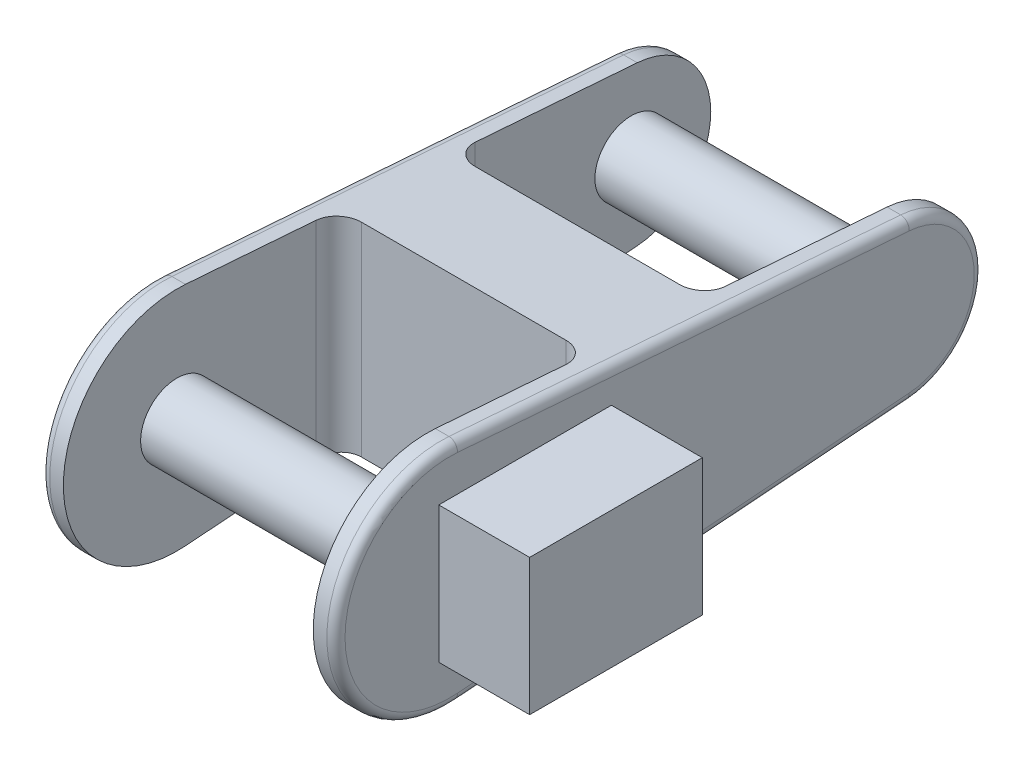
ISO-10303-21;
HEADER;
FILE_DESCRIPTION(('STEP AP214'),'2;1');
FILE_NAME('part.step','',(''),(''),'','','');
FILE_SCHEMA(('AUTOMOTIVE_DESIGN { 1 0 10303 214 1 1 1 1 }'));
ENDSEC;
DATA;
#1=APPLICATION_CONTEXT('core data for automotive mechanical design processes');
#2=APPLICATION_PROTOCOL_DEFINITION('international standard','automotive_design',2000,#1);
#3=PRODUCT_CONTEXT('',#1,'mechanical');
#4=PRODUCT('Part','Part','',(#3));
#5=PRODUCT_RELATED_PRODUCT_CATEGORY('part','',(#4));
#6=PRODUCT_DEFINITION_FORMATION('','',#4);
#7=PRODUCT_DEFINITION_CONTEXT('part definition',#1,'design');
#8=PRODUCT_DEFINITION('design','',#6,#7);
#9=PRODUCT_DEFINITION_SHAPE('','',#8);
#10=(LENGTH_UNIT() NAMED_UNIT(*) SI_UNIT(.MILLI.,.METRE.));
#11=(NAMED_UNIT(*) PLANE_ANGLE_UNIT() SI_UNIT($,.RADIAN.));
#12=(NAMED_UNIT(*) SI_UNIT($,.STERADIAN.) SOLID_ANGLE_UNIT());
#13=UNCERTAINTY_MEASURE_WITH_UNIT(LENGTH_MEASURE(1.E-05),#10,'distance_accuracy_value','');
#14=(GEOMETRIC_REPRESENTATION_CONTEXT(3) GLOBAL_UNCERTAINTY_ASSIGNED_CONTEXT((#13)) GLOBAL_UNIT_ASSIGNED_CONTEXT((#10,
#11,#12)) REPRESENTATION_CONTEXT('',''));
#15=CARTESIAN_POINT('',(0.,0.,0.));
#16=DIRECTION('',(0.,0.,1.));
#17=DIRECTION('',(1.,0.,0.));
#18=AXIS2_PLACEMENT_3D('',#15,#16,#17);
#19=CARTESIAN_POINT('',(32.5,0.,0.));
#20=DIRECTION('',(-1.,0.,0.));
#21=DIRECTION('',(0.,0.,1.));
#22=AXIS2_PLACEMENT_3D('',#19,#20,#21);
#23=CYLINDRICAL_SURFACE('',#22,25.);
#24=DIRECTION('',(-1.,0.,0.));
#25=VECTOR('',#24,1.);
#26=CARTESIAN_POINT('',(32.5,24.9295883439739,-1.875));
#27=LINE('',#26,#25);
#28=CARTESIAN_POINT('',(-27.5,24.9295883439739,-1.875));
#29=VERTEX_POINT('',#28);
#30=CARTESIAN_POINT('',(-30.5,24.9295883439739,-1.875));
#31=VERTEX_POINT('',#30);
#32=EDGE_CURVE('E252',#29,#31,#27,.T.);
#33=ORIENTED_EDGE('',*,*,#32,.T.);
#34=CARTESIAN_POINT('',(-30.5,0.,0.));
#35=DIRECTION('',(1.,0.,0.));
#36=DIRECTION('',(0.,0.,-1.));
#37=AXIS2_PLACEMENT_3D('',#34,#35,#36);
#38=CIRCLE('',#37,25.);
#39=CARTESIAN_POINT('',(-30.5,-24.9295883439739,-1.875));
#40=VERTEX_POINT('',#39);
#41=EDGE_CURVE('E343',#31,#40,#38,.T.);
#42=ORIENTED_EDGE('',*,*,#41,.T.);
#43=DIRECTION('',(-1.,0.,0.));
#44=VECTOR('',#43,1.);
#45=CARTESIAN_POINT('',(32.5,-24.9295883439739,-1.875));
#46=LINE('',#45,#44);
#47=CARTESIAN_POINT('',(-27.5,-24.9295883439739,-1.87499999999999));
#48=VERTEX_POINT('',#47);
#49=EDGE_CURVE('E263',#48,#40,#46,.T.);
#50=ORIENTED_EDGE('',*,*,#49,.F.);
#51=CARTESIAN_POINT('',(-27.5,0.,0.));
#52=DIRECTION('',(-1.,0.,0.));
#53=DIRECTION('',(0.,0.,1.));
#54=AXIS2_PLACEMENT_3D('',#51,#52,#53);
#55=CIRCLE('',#54,25.);
#56=EDGE_CURVE('E248',#48,#29,#55,.T.);
#57=ORIENTED_EDGE('',*,*,#56,.T.);
#58=EDGE_LOOP('',(#33,#42,#50,#57));
#59=FACE_BOUND('',#58,.T.);
#60=ADVANCED_FACE('F38',(#59),#23,.T.);
#61=CARTESIAN_POINT('',(32.5,0.,-100.));
#62=DIRECTION('',(-1.,0.,0.));
#63=DIRECTION('',(0.,0.,1.));
#64=AXIS2_PLACEMENT_3D('',#61,#62,#63);
#65=CYLINDRICAL_SURFACE('',#64,17.5);
#66=DIRECTION('',(-1.,0.,0.));
#67=VECTOR('',#66,1.);
#68=CARTESIAN_POINT('',(32.5,-17.4507118407818,-101.3125));
#69=LINE('',#68,#67);
#70=CARTESIAN_POINT('',(-27.5,-17.4507118407818,-101.3125));
#71=VERTEX_POINT('',#70);
#72=CARTESIAN_POINT('',(-30.5,-17.4507118407818,-101.3125));
#73=VERTEX_POINT('',#72);
#74=EDGE_CURVE('E259',#71,#73,#69,.T.);
#75=ORIENTED_EDGE('',*,*,#74,.T.);
#76=CARTESIAN_POINT('',(-30.5,0.,-100.));
#77=DIRECTION('',(1.,0.,0.));
#78=DIRECTION('',(0.,0.,-1.));
#79=AXIS2_PLACEMENT_3D('',#76,#77,#78);
#80=CIRCLE('',#79,17.5);
#81=CARTESIAN_POINT('',(-30.5,17.4507118407818,-101.3125));
#82=VERTEX_POINT('',#81);
#83=EDGE_CURVE('E317',#73,#82,#80,.T.);
#84=ORIENTED_EDGE('',*,*,#83,.T.);
#85=DIRECTION('',(-1.,0.,0.));
#86=VECTOR('',#85,1.);
#87=CARTESIAN_POINT('',(32.5,17.4507118407818,-101.3125));
#88=LINE('',#87,#86);
#89=CARTESIAN_POINT('',(-27.5,17.4507118407818,-101.3125));
#90=VERTEX_POINT('',#89);
#91=EDGE_CURVE('E256',#90,#82,#88,.T.);
#92=ORIENTED_EDGE('',*,*,#91,.F.);
#93=CARTESIAN_POINT('',(-27.5,0.,-100.));
#94=DIRECTION('',(-1.,0.,0.));
#95=DIRECTION('',(0.,0.,1.));
#96=AXIS2_PLACEMENT_3D('',#93,#94,#95);
#97=CIRCLE('',#96,17.5);
#98=EDGE_CURVE('E235',#90,#71,#97,.T.);
#99=ORIENTED_EDGE('',*,*,#98,.T.);
#100=EDGE_LOOP('',(#75,#84,#92,#99));
#101=FACE_BOUND('',#100,.T.);
#102=ADVANCED_FACE('F419',(#101),#65,.T.);
#103=CARTESIAN_POINT('',(30.5,-24.9295883439739,-1.875));
#104=VERTEX_POINT('',#103);
#105=CARTESIAN_POINT('',(27.5,-24.9295883439739,-1.87499999999999));
#106=VERTEX_POINT('',#105);
#107=EDGE_CURVE('E264',#104,#106,#46,.T.);
#108=ORIENTED_EDGE('',*,*,#107,.F.);
#109=CARTESIAN_POINT('',(30.5,0.,0.));
#110=DIRECTION('',(1.,0.,0.));
#111=DIRECTION('',(0.,0.,-1.));
#112=AXIS2_PLACEMENT_3D('',#109,#110,#111);
#113=CIRCLE('',#112,25.);
#114=CARTESIAN_POINT('',(30.5,24.9295883439739,-1.875));
#115=VERTEX_POINT('',#114);
#116=EDGE_CURVE('E313',#104,#115,#113,.F.);
#117=ORIENTED_EDGE('',*,*,#116,.T.);
#118=CARTESIAN_POINT('',(27.5,24.9295883439739,-1.875));
#119=VERTEX_POINT('',#118);
#120=EDGE_CURVE('E253',#115,#119,#27,.T.);
#121=ORIENTED_EDGE('',*,*,#120,.T.);
#122=CARTESIAN_POINT('',(27.5,0.,0.));
#123=DIRECTION('',(1.,0.,0.));
#124=DIRECTION('',(0.,0.,-1.));
#125=AXIS2_PLACEMENT_3D('',#122,#123,#124);
#126=CIRCLE('',#125,25.);
#127=EDGE_CURVE('E241',#119,#106,#126,.T.);
#128=ORIENTED_EDGE('',*,*,#127,.T.);
#129=EDGE_LOOP('',(#108,#117,#121,#128));
#130=FACE_BOUND('',#129,.T.);
#131=ADVANCED_FACE('F422',(#130),#23,.T.);
#132=CARTESIAN_POINT('',(32.5,-24.9295883439739,-1.875));
#133=DIRECTION('',(0.,0.997183533758957,0.0749999999999998));
#134=DIRECTION('',(0.,-0.0749999999999998,0.997183533758957));
#135=AXIS2_PLACEMENT_3D('',#132,#133,#134);
#136=PLANE('',#135);
#137=ORIENTED_EDGE('',*,*,#49,.T.);
#138=DIRECTION('',(0.,0.0749999999999998,-0.997183533758957));
#139=VECTOR('',#138,1.);
#140=CARTESIAN_POINT('',(-30.5,-24.9295883439739,-1.875));
#141=LINE('',#140,#139);
#142=EDGE_CURVE('E341',#40,#73,#141,.T.);
#143=ORIENTED_EDGE('',*,*,#142,.T.);
#144=ORIENTED_EDGE('',*,*,#74,.F.);
#145=DIRECTION('',(0.,-0.0749999999999998,0.997183533758957));
#146=VECTOR('',#145,1.);
#147=CARTESIAN_POINT('',(-27.5,-24.9295883439739,-1.875));
#148=LINE('',#147,#146);
#149=CARTESIAN_POINT('',(-27.5,-20.1340632159431,-65.6352492453292));
#150=VERTEX_POINT('',#149);
#151=EDGE_CURVE('E238',#71,#150,#148,.T.);
#152=ORIENTED_EDGE('',*,*,#151,.T.);
#153=CARTESIAN_POINT('',(-22.5,-20.1340632159431,-65.6352492453292));
#154=DIRECTION('',(0.,0.997183533758957,0.0749999999999998));
#155=DIRECTION('',(0.,-0.0749999999999998,0.997183533758957));
#156=AXIS2_PLACEMENT_3D('',#153,#154,#155);
#157=ELLIPSE('',#156,5.014122105639,5.);
#158=CARTESIAN_POINT('',(-22.5,-20.510122373866,-60.6352492453292));
#159=VERTEX_POINT('',#158);
#160=EDGE_CURVE('E373',#150,#159,#157,.T.);
#161=ORIENTED_EDGE('',*,*,#160,.T.);
#162=DIRECTION('',(1.,0.,0.));
#163=VECTOR('',#162,1.);
#164=CARTESIAN_POINT('',(32.5,-20.510122373866,-60.6352492453292));
#165=LINE('',#164,#163);
#166=CARTESIAN_POINT('',(22.5,-20.510122373866,-60.6352492453292));
#167=VERTEX_POINT('',#166);
#168=EDGE_CURVE('E223',#159,#167,#165,.T.);
#169=ORIENTED_EDGE('',*,*,#168,.T.);
#170=CARTESIAN_POINT('',(22.5,-20.1340632159431,-65.6352492453292));
#171=DIRECTION('',(0.,0.997183533758957,0.0749999999999998));
#172=DIRECTION('',(0.,-0.0749999999999998,0.997183533758957));
#173=AXIS2_PLACEMENT_3D('',#170,#171,#172);
#174=ELLIPSE('',#173,5.014122105639,5.);
#175=CARTESIAN_POINT('',(27.5,-20.1340632159431,-65.6352492453292));
#176=VERTEX_POINT('',#175);
#177=EDGE_CURVE('E364',#167,#176,#174,.T.);
#178=ORIENTED_EDGE('',*,*,#177,.T.);
#179=DIRECTION('',(0.,0.0749999999999998,-0.997183533758957));
#180=VECTOR('',#179,1.);
#181=CARTESIAN_POINT('',(27.5,-24.9295883439739,-1.875));
#182=LINE('',#181,#180);
#183=CARTESIAN_POINT('',(27.5,-17.4507118407818,-101.3125));
#184=VERTEX_POINT('',#183);
#185=EDGE_CURVE('E233',#176,#184,#182,.T.);
#186=ORIENTED_EDGE('',*,*,#185,.T.);
#187=CARTESIAN_POINT('',(30.5,-17.4507118407818,-101.3125));
#188=VERTEX_POINT('',#187);
#189=EDGE_CURVE('E260',#188,#184,#69,.T.);
#190=ORIENTED_EDGE('',*,*,#189,.F.);
#191=DIRECTION('',(0.,0.0749999999999998,-0.997183533758957));
#192=VECTOR('',#191,1.);
#193=CARTESIAN_POINT('',(30.5,-24.9295883439739,-1.875));
#194=LINE('',#193,#192);
#195=EDGE_CURVE('E311',#188,#104,#194,.F.);
#196=ORIENTED_EDGE('',*,*,#195,.T.);
#197=ORIENTED_EDGE('',*,*,#107,.T.);
#198=DIRECTION('',(0.,0.0749999999999998,-0.997183533758957));
#199=VECTOR('',#198,1.);
#200=CARTESIAN_POINT('',(27.5,-24.9295883439739,-1.875));
#201=LINE('',#200,#199);
#202=CARTESIAN_POINT('',(27.5,-22.7664773214035,-30.6352492453292));
#203=VERTEX_POINT('',#202);
#204=EDGE_CURVE('E244',#106,#203,#201,.T.);
#205=ORIENTED_EDGE('',*,*,#204,.T.);
#206=CARTESIAN_POINT('',(22.5,-22.7664773214035,-30.6352492453292));
#207=DIRECTION('',(0.,0.997183533758957,0.0749999999999998));
#208=DIRECTION('',(0.,-0.0749999999999998,0.997183533758957));
#209=AXIS2_PLACEMENT_3D('',#206,#207,#208);
#210=ELLIPSE('',#209,5.014122105639,5.);
#211=CARTESIAN_POINT('',(22.5,-22.3904181634806,-35.6352492453292));
#212=VERTEX_POINT('',#211);
#213=EDGE_CURVE('E11',#203,#212,#210,.T.);
#214=ORIENTED_EDGE('',*,*,#213,.T.);
#215=DIRECTION('',(-1.,0.,0.));
#216=VECTOR('',#215,1.);
#217=CARTESIAN_POINT('',(32.5,-22.3904181634806,-35.6352492453292));
#218=LINE('',#217,#216);
#219=CARTESIAN_POINT('',(-22.5,-22.3904181634806,-35.6352492453292));
#220=VERTEX_POINT('',#219);
#221=EDGE_CURVE('E246',#212,#220,#218,.T.);
#222=ORIENTED_EDGE('',*,*,#221,.T.);
#223=CARTESIAN_POINT('',(-22.5,-22.7664773214035,-30.6352492453292));
#224=DIRECTION('',(0.,0.997183533758957,0.0749999999999998));
#225=DIRECTION('',(0.,-0.0749999999999998,0.997183533758957));
#226=AXIS2_PLACEMENT_3D('',#223,#224,#225);
#227=ELLIPSE('',#226,5.014122105639,5.);
#228=CARTESIAN_POINT('',(-27.5,-22.7664773214035,-30.6352492453292));
#229=VERTEX_POINT('',#228);
#230=EDGE_CURVE('E383',#220,#229,#227,.T.);
#231=ORIENTED_EDGE('',*,*,#230,.T.);
#232=DIRECTION('',(0.,-0.0749999999999998,0.997183533758957));
#233=VECTOR('',#232,1.);
#234=CARTESIAN_POINT('',(-27.5,-24.9295883439739,-1.875));
#235=LINE('',#234,#233);
#236=EDGE_CURVE('E250',#229,#48,#235,.T.);
#237=ORIENTED_EDGE('',*,*,#236,.T.);
#238=EDGE_LOOP('',(#137,#143,#144,#152,#161,#169,#178,#186,#190,#196,#197,#205,#214,#222,#231,#237));
#239=FACE_BOUND('',#238,.T.);
#240=ADVANCED_FACE('F411',(#239),#136,.F.);
#241=CARTESIAN_POINT('',(30.5,17.4507118407818,-101.3125));
#242=VERTEX_POINT('',#241);
#243=CARTESIAN_POINT('',(27.5,17.4507118407818,-101.3125));
#244=VERTEX_POINT('',#243);
#245=EDGE_CURVE('E257',#242,#244,#88,.T.);
#246=ORIENTED_EDGE('',*,*,#245,.F.);
#247=CARTESIAN_POINT('',(30.5,0.,-100.));
#248=DIRECTION('',(1.,0.,0.));
#249=DIRECTION('',(0.,0.,-1.));
#250=AXIS2_PLACEMENT_3D('',#247,#248,#249);
#251=CIRCLE('',#250,17.5);
#252=EDGE_CURVE('E308',#242,#188,#251,.F.);
#253=ORIENTED_EDGE('',*,*,#252,.T.);
#254=ORIENTED_EDGE('',*,*,#189,.T.);
#255=CARTESIAN_POINT('',(27.5,0.,-100.));
#256=DIRECTION('',(1.,0.,0.));
#257=DIRECTION('',(0.,0.,-1.));
#258=AXIS2_PLACEMENT_3D('',#255,#256,#257);
#259=CIRCLE('',#258,17.5);
#260=EDGE_CURVE('E225',#184,#244,#259,.T.);
#261=ORIENTED_EDGE('',*,*,#260,.T.);
#262=EDGE_LOOP('',(#246,#253,#254,#261));
#263=FACE_BOUND('',#262,.T.);
#264=ADVANCED_FACE('F428',(#263),#65,.T.);
#265=CARTESIAN_POINT('',(32.5,24.9295883439739,-1.875));
#266=DIRECTION('',(0.,-0.997183533758957,0.0749999999999998));
#267=DIRECTION('',(0.,-0.0749999999999998,-0.997183533758957));
#268=AXIS2_PLACEMENT_3D('',#265,#266,#267);
#269=PLANE('',#268);
#270=ORIENTED_EDGE('',*,*,#91,.T.);
#271=DIRECTION('',(0.,0.0749999999999998,0.997183533758957));
#272=VECTOR('',#271,1.);
#273=CARTESIAN_POINT('',(-30.5,24.9295883439739,-1.875));
#274=LINE('',#273,#272);
#275=EDGE_CURVE('E345',#82,#31,#274,.T.);
#276=ORIENTED_EDGE('',*,*,#275,.T.);
#277=ORIENTED_EDGE('',*,*,#32,.F.);
#278=DIRECTION('',(0.,-0.0749999999999998,-0.997183533758957));
#279=VECTOR('',#278,1.);
#280=CARTESIAN_POINT('',(-27.5,24.9295883439739,-1.875));
#281=LINE('',#280,#279);
#282=CARTESIAN_POINT('',(-27.5,22.7664773214035,-30.6352492453292));
#283=VERTEX_POINT('',#282);
#284=EDGE_CURVE('E278',#29,#283,#281,.T.);
#285=ORIENTED_EDGE('',*,*,#284,.T.);
#286=CARTESIAN_POINT('',(-22.5,22.7664773214035,-30.6352492453292));
#287=DIRECTION('',(0.,-0.997183533758957,0.0749999999999998));
#288=DIRECTION('',(0.,-0.0749999999999998,-0.997183533758957));
#289=AXIS2_PLACEMENT_3D('',#286,#287,#288);
#290=ELLIPSE('',#289,5.014122105639,5.);
#291=CARTESIAN_POINT('',(-22.5,22.3904181634806,-35.6352492453292));
#292=VERTEX_POINT('',#291);
#293=EDGE_CURVE('E381',#283,#292,#290,.T.);
#294=ORIENTED_EDGE('',*,*,#293,.T.);
#295=DIRECTION('',(1.,0.,0.));
#296=VECTOR('',#295,1.);
#297=CARTESIAN_POINT('',(32.5,22.3904181634806,-35.6352492453292));
#298=LINE('',#297,#296);
#299=CARTESIAN_POINT('',(22.5,22.3904181634806,-35.6352492453292));
#300=VERTEX_POINT('',#299);
#301=EDGE_CURVE('E276',#292,#300,#298,.T.);
#302=ORIENTED_EDGE('',*,*,#301,.T.);
#303=CARTESIAN_POINT('',(22.5,22.7664773214035,-30.6352492453292));
#304=DIRECTION('',(0.,-0.997183533758957,0.0749999999999998));
#305=DIRECTION('',(0.,-0.0749999999999998,-0.997183533758957));
#306=AXIS2_PLACEMENT_3D('',#303,#304,#305);
#307=ELLIPSE('',#306,5.014122105639,5.);
#308=CARTESIAN_POINT('',(27.5,22.7664773214035,-30.6352492453292));
#309=VERTEX_POINT('',#308);
#310=EDGE_CURVE('E46',#300,#309,#307,.T.);
#311=ORIENTED_EDGE('',*,*,#310,.T.);
#312=DIRECTION('',(0.,0.0749999999999998,0.997183533758957));
#313=VECTOR('',#312,1.);
#314=CARTESIAN_POINT('',(27.5,24.9295883439739,-1.875));
#315=LINE('',#314,#313);
#316=EDGE_CURVE('E274',#309,#119,#315,.T.);
#317=ORIENTED_EDGE('',*,*,#316,.T.);
#318=ORIENTED_EDGE('',*,*,#120,.F.);
#319=DIRECTION('',(0.,0.0749999999999998,0.997183533758957));
#320=VECTOR('',#319,1.);
#321=CARTESIAN_POINT('',(30.5,17.4507118407818,-101.3125));
#322=LINE('',#321,#320);
#323=EDGE_CURVE('E315',#115,#242,#322,.F.);
#324=ORIENTED_EDGE('',*,*,#323,.T.);
#325=ORIENTED_EDGE('',*,*,#245,.T.);
#326=DIRECTION('',(0.,0.0749999999999998,0.997183533758957));
#327=VECTOR('',#326,1.);
#328=CARTESIAN_POINT('',(27.5,24.9295883439739,-1.875));
#329=LINE('',#328,#327);
#330=CARTESIAN_POINT('',(27.5,20.1340632159431,-65.6352492453292));
#331=VERTEX_POINT('',#330);
#332=EDGE_CURVE('E269',#244,#331,#329,.T.);
#333=ORIENTED_EDGE('',*,*,#332,.T.);
#334=CARTESIAN_POINT('',(22.5,20.1340632159431,-65.6352492453292));
#335=DIRECTION('',(0.,-0.997183533758957,0.0749999999999998));
#336=DIRECTION('',(0.,-0.0749999999999998,-0.997183533758957));
#337=AXIS2_PLACEMENT_3D('',#334,#335,#336);
#338=ELLIPSE('',#337,5.014122105639,5.);
#339=CARTESIAN_POINT('',(22.5,20.510122373866,-60.6352492453292));
#340=VERTEX_POINT('',#339);
#341=EDGE_CURVE('E362',#331,#340,#338,.T.);
#342=ORIENTED_EDGE('',*,*,#341,.T.);
#343=DIRECTION('',(-1.,0.,0.));
#344=VECTOR('',#343,1.);
#345=CARTESIAN_POINT('',(32.5,20.510122373866,-60.6352492453292));
#346=LINE('',#345,#344);
#347=CARTESIAN_POINT('',(-22.5,20.510122373866,-60.6352492453292));
#348=VERTEX_POINT('',#347);
#349=EDGE_CURVE('E266',#340,#348,#346,.T.);
#350=ORIENTED_EDGE('',*,*,#349,.T.);
#351=CARTESIAN_POINT('',(-22.5,20.1340632159431,-65.6352492453292));
#352=DIRECTION('',(0.,-0.997183533758957,0.0749999999999998));
#353=DIRECTION('',(0.,-0.0749999999999998,-0.997183533758957));
#354=AXIS2_PLACEMENT_3D('',#351,#352,#353);
#355=ELLIPSE('',#354,5.014122105639,5.);
#356=CARTESIAN_POINT('',(-27.5,20.1340632159431,-65.6352492453292));
#357=VERTEX_POINT('',#356);
#358=EDGE_CURVE('E371',#348,#357,#355,.T.);
#359=ORIENTED_EDGE('',*,*,#358,.T.);
#360=DIRECTION('',(0.,-0.0749999999999998,-0.997183533758957));
#361=VECTOR('',#360,1.);
#362=CARTESIAN_POINT('',(-27.5,24.9295883439739,-1.875));
#363=LINE('',#362,#361);
#364=EDGE_CURVE('E272',#357,#90,#363,.T.);
#365=ORIENTED_EDGE('',*,*,#364,.T.);
#366=EDGE_LOOP('',(#270,#276,#277,#285,#294,#302,#311,#317,#318,#324,#325,#333,#342,#350,#359,#365));
#367=FACE_BOUND('',#366,.T.);
#368=ADVANCED_FACE('F397',(#367),#269,.F.);
#369=CARTESIAN_POINT('',(32.5,0.,0.));
#370=DIRECTION('',(1.,0.,0.));
#371=DIRECTION('',(0.,0.,-1.));
#372=AXIS2_PLACEMENT_3D('',#369,#370,#371);
#373=PLANE('',#372);
#374=DIRECTION('',(0.,0.0749999999999998,-0.997183533758957));
#375=VECTOR('',#374,1.);
#376=CARTESIAN_POINT('',(32.5,-15.4563447732639,-101.1625));
#377=LINE('',#376,#375);
#378=CARTESIAN_POINT('',(32.5,-22.935221276456,-1.725));
#379=VERTEX_POINT('',#378);
#380=CARTESIAN_POINT('',(32.5,-15.4563447732638,-101.1625));
#381=VERTEX_POINT('',#380);
#382=EDGE_CURVE('E303',#379,#381,#377,.T.);
#383=ORIENTED_EDGE('',*,*,#382,.T.);
#384=CARTESIAN_POINT('',(32.5,0.,-100.));
#385=DIRECTION('',(1.,0.,0.));
#386=DIRECTION('',(0.,0.,-1.));
#387=AXIS2_PLACEMENT_3D('',#384,#385,#386);
#388=CIRCLE('',#387,15.5);
#389=CARTESIAN_POINT('',(32.5,15.4563447732638,-101.1625));
#390=VERTEX_POINT('',#389);
#391=EDGE_CURVE('E305',#381,#390,#388,.T.);
#392=ORIENTED_EDGE('',*,*,#391,.T.);
#393=DIRECTION('',(0.,0.0749999999999998,0.997183533758957));
#394=VECTOR('',#393,1.);
#395=CARTESIAN_POINT('',(32.5,22.935221276456,-1.725));
#396=LINE('',#395,#394);
#397=CARTESIAN_POINT('',(32.5,22.935221276456,-1.725));
#398=VERTEX_POINT('',#397);
#399=EDGE_CURVE('E299',#390,#398,#396,.T.);
#400=ORIENTED_EDGE('',*,*,#399,.T.);
#401=CARTESIAN_POINT('',(32.5,0.,0.));
#402=DIRECTION('',(1.,0.,0.));
#403=DIRECTION('',(0.,0.,-1.));
#404=AXIS2_PLACEMENT_3D('',#401,#402,#403);
#405=CIRCLE('',#404,23.);
#406=EDGE_CURVE('E301',#398,#379,#405,.T.);
#407=ORIENTED_EDGE('',*,*,#406,.T.);
#408=EDGE_LOOP('',(#383,#392,#400,#407));
#409=FACE_BOUND('',#408,.T.);
#410=DIRECTION('',(0.,1.,0.));
#411=VECTOR('',#410,1.);
#412=CARTESIAN_POINT('',(32.5,-15.,-35.6352492453292));
#413=LINE('',#412,#411);
#414=CARTESIAN_POINT('',(32.5,-15.,-35.6352492453292));
#415=VERTEX_POINT('',#414);
#416=CARTESIAN_POINT('',(32.5,15.,-35.6352492453292));
#417=VERTEX_POINT('',#416);
#418=EDGE_CURVE('E222',#415,#417,#413,.T.);
#419=ORIENTED_EDGE('',*,*,#418,.F.);
#420=DIRECTION('',(0.,0.,-1.));
#421=VECTOR('',#420,1.);
#422=CARTESIAN_POINT('',(32.5,-15.,2.36475075467077));
#423=LINE('',#422,#421);
#424=CARTESIAN_POINT('',(32.5,-15.,2.36475075467077));
#425=VERTEX_POINT('',#424);
#426=EDGE_CURVE('E219',#425,#415,#423,.T.);
#427=ORIENTED_EDGE('',*,*,#426,.F.);
#428=DIRECTION('',(0.,-1.,0.));
#429=VECTOR('',#428,1.);
#430=CARTESIAN_POINT('',(32.5,15.,2.36475075467078));
#431=LINE('',#430,#429);
#432=CARTESIAN_POINT('',(32.5,15.,2.36475075467078));
#433=VERTEX_POINT('',#432);
#434=EDGE_CURVE('E818',#433,#425,#431,.T.);
#435=ORIENTED_EDGE('',*,*,#434,.F.);
#436=DIRECTION('',(0.,0.,1.));
#437=VECTOR('',#436,1.);
#438=CARTESIAN_POINT('',(32.5,15.,2.36475075467078));
#439=LINE('',#438,#437);
#440=EDGE_CURVE('E820',#417,#433,#439,.T.);
#441=ORIENTED_EDGE('',*,*,#440,.F.);
#442=EDGE_LOOP('',(#419,#427,#435,#441));
#443=FACE_BOUND('',#442,.T.);
#444=ADVANCED_FACE('F454',(#409,#443),#373,.T.);
#445=CARTESIAN_POINT('',(-32.5,0.,0.));
#446=DIRECTION('',(1.,0.,0.));
#447=DIRECTION('',(0.,0.,-1.));
#448=AXIS2_PLACEMENT_3D('',#445,#446,#447);
#449=PLANE('',#448);
#450=DIRECTION('',(0.,0.0749999999999998,0.997183533758957));
#451=VECTOR('',#450,1.);
#452=CARTESIAN_POINT('',(-32.5,22.935221276456,-1.725));
#453=LINE('',#452,#451);
#454=CARTESIAN_POINT('',(-32.5,22.935221276456,-1.725));
#455=VERTEX_POINT('',#454);
#456=CARTESIAN_POINT('',(-32.5,15.4563447732638,-101.1625));
#457=VERTEX_POINT('',#456);
#458=EDGE_CURVE('E332',#455,#457,#453,.F.);
#459=ORIENTED_EDGE('',*,*,#458,.T.);
#460=CARTESIAN_POINT('',(-32.5,0.,-100.));
#461=DIRECTION('',(1.,0.,0.));
#462=DIRECTION('',(0.,0.,-1.));
#463=AXIS2_PLACEMENT_3D('',#460,#461,#462);
#464=CIRCLE('',#463,15.5);
#465=CARTESIAN_POINT('',(-32.5,-15.4563447732638,-101.1625));
#466=VERTEX_POINT('',#465);
#467=EDGE_CURVE('E338',#457,#466,#464,.F.);
#468=ORIENTED_EDGE('',*,*,#467,.T.);
#469=DIRECTION('',(0.,0.0749999999999998,-0.997183533758957));
#470=VECTOR('',#469,1.);
#471=CARTESIAN_POINT('',(-32.5,-22.935221276456,-1.725));
#472=LINE('',#471,#470);
#473=CARTESIAN_POINT('',(-32.5,-22.935221276456,-1.725));
#474=VERTEX_POINT('',#473);
#475=EDGE_CURVE('E336',#466,#474,#472,.F.);
#476=ORIENTED_EDGE('',*,*,#475,.T.);
#477=CARTESIAN_POINT('',(-32.5,0.,0.));
#478=DIRECTION('',(1.,0.,0.));
#479=DIRECTION('',(0.,0.,-1.));
#480=AXIS2_PLACEMENT_3D('',#477,#478,#479);
#481=CIRCLE('',#480,23.);
#482=EDGE_CURVE('E334',#474,#455,#481,.F.);
#483=ORIENTED_EDGE('',*,*,#482,.T.);
#484=EDGE_LOOP('',(#459,#468,#476,#483));
#485=FACE_BOUND('',#484,.T.);
#486=ADVANCED_FACE('F533',(#485),#449,.F.);
#487=CARTESIAN_POINT('',(-27.5,-32.5,-117.5));
#488=DIRECTION('',(-1.,0.,0.));
#489=DIRECTION('',(0.,0.,1.));
#490=AXIS2_PLACEMENT_3D('',#487,#488,#489);
#491=PLANE('',#490);
#492=CARTESIAN_POINT('',(-27.5,0.,-100.));
#493=DIRECTION('',(-1.,0.,0.));
#494=DIRECTION('',(0.,0.,1.));
#495=AXIS2_PLACEMENT_3D('',#492,#493,#494);
#496=CIRCLE('',#495,8.00000000000001);
#497=CARTESIAN_POINT('',(-27.5,0.,-92.));
#498=VERTEX_POINT('',#497);
#499=EDGE_CURVE('E290',#498,#498,#496,.F.);
#500=ORIENTED_EDGE('',*,*,#499,.F.);
#501=EDGE_LOOP('',(#500));
#502=FACE_BOUND('',#501,.T.);
#503=ORIENTED_EDGE('',*,*,#364,.F.);
#504=DIRECTION('',(0.,1.,0.));
#505=VECTOR('',#504,1.);
#506=CARTESIAN_POINT('',(-27.5,-20.510122373866,-65.6352492453292));
#507=LINE('',#506,#505);
#508=EDGE_CURVE('E369',#357,#150,#507,.F.);
#509=ORIENTED_EDGE('',*,*,#508,.T.);
#510=ORIENTED_EDGE('',*,*,#151,.F.);
#511=ORIENTED_EDGE('',*,*,#98,.F.);
#512=EDGE_LOOP('',(#503,#509,#510,#511));
#513=FACE_BOUND('',#512,.T.);
#514=ADVANCED_FACE('F520',(#502,#513),#491,.F.);
#515=CARTESIAN_POINT('',(27.5,-32.5,-117.5));
#516=DIRECTION('',(1.,0.,0.));
#517=DIRECTION('',(0.,0.,-1.));
#518=AXIS2_PLACEMENT_3D('',#515,#516,#517);
#519=PLANE('',#518);
#520=CARTESIAN_POINT('',(27.5,0.,-100.));
#521=DIRECTION('',(1.,0.,0.));
#522=DIRECTION('',(0.,0.,-1.));
#523=AXIS2_PLACEMENT_3D('',#520,#521,#522);
#524=CIRCLE('',#523,8.00000000000001);
#525=CARTESIAN_POINT('',(27.5,0.,-108.));
#526=VERTEX_POINT('',#525);
#527=EDGE_CURVE('E287',#526,#526,#524,.F.);
#528=ORIENTED_EDGE('',*,*,#527,.F.);
#529=EDGE_LOOP('',(#528));
#530=FACE_BOUND('',#529,.T.);
#531=ORIENTED_EDGE('',*,*,#185,.F.);
#532=DIRECTION('',(0.,1.,0.));
#533=VECTOR('',#532,1.);
#534=CARTESIAN_POINT('',(27.5,20.510122373866,-65.6352492453292));
#535=LINE('',#534,#533);
#536=EDGE_CURVE('E347',#176,#331,#535,.T.);
#537=ORIENTED_EDGE('',*,*,#536,.T.);
#538=ORIENTED_EDGE('',*,*,#332,.F.);
#539=ORIENTED_EDGE('',*,*,#260,.F.);
#540=EDGE_LOOP('',(#531,#537,#538,#539));
#541=FACE_BOUND('',#540,.T.);
#542=ADVANCED_FACE('F516',(#530,#541),#519,.F.);
#543=CARTESIAN_POINT('',(-27.5,-32.5,-60.6352492453292));
#544=DIRECTION('',(0.,0.,1.));
#545=DIRECTION('',(1.,0.,0.));
#546=AXIS2_PLACEMENT_3D('',#543,#544,#545);
#547=PLANE('',#546);
#548=ORIENTED_EDGE('',*,*,#168,.F.);
#549=DIRECTION('',(0.,1.,0.));
#550=VECTOR('',#549,1.);
#551=CARTESIAN_POINT('',(-22.5,20.510122373866,-60.6352492453292));
#552=LINE('',#551,#550);
#553=EDGE_CURVE('E366',#159,#348,#552,.T.);
#554=ORIENTED_EDGE('',*,*,#553,.T.);
#555=ORIENTED_EDGE('',*,*,#349,.F.);
#556=DIRECTION('',(0.,1.,0.));
#557=VECTOR('',#556,1.);
#558=CARTESIAN_POINT('',(22.5,-20.510122373866,-60.6352492453292));
#559=LINE('',#558,#557);
#560=EDGE_CURVE('E359',#340,#167,#559,.F.);
#561=ORIENTED_EDGE('',*,*,#560,.T.);
#562=EDGE_LOOP('',(#548,#554,#555,#561));
#563=FACE_BOUND('',#562,.T.);
#564=ADVANCED_FACE('F509',(#563),#547,.F.);
#565=CARTESIAN_POINT('',(-27.5,-32.5,-35.6352492453292));
#566=DIRECTION('',(-1.,0.,0.));
#567=DIRECTION('',(0.,0.,1.));
#568=AXIS2_PLACEMENT_3D('',#565,#566,#567);
#569=PLANE('',#568);
#570=CARTESIAN_POINT('',(-27.5,0.,0.));
#571=DIRECTION('',(-1.,0.,0.));
#572=DIRECTION('',(0.,0.,1.));
#573=AXIS2_PLACEMENT_3D('',#570,#571,#572);
#574=CIRCLE('',#573,8.);
#575=CARTESIAN_POINT('',(-27.5,0.,8.));
#576=VERTEX_POINT('',#575);
#577=EDGE_CURVE('E284',#576,#576,#574,.F.);
#578=ORIENTED_EDGE('',*,*,#577,.F.);
#579=EDGE_LOOP('',(#578));
#580=FACE_BOUND('',#579,.T.);
#581=ORIENTED_EDGE('',*,*,#236,.F.);
#582=DIRECTION('',(0.,1.,0.));
#583=VECTOR('',#582,1.);
#584=CARTESIAN_POINT('',(-27.5,22.3904181634806,-30.6352492453292));
#585=LINE('',#584,#583);
#586=EDGE_CURVE('E375',#229,#283,#585,.T.);
#587=ORIENTED_EDGE('',*,*,#586,.T.);
#588=ORIENTED_EDGE('',*,*,#284,.F.);
#589=ORIENTED_EDGE('',*,*,#56,.F.);
#590=EDGE_LOOP('',(#581,#587,#588,#589));
#591=FACE_BOUND('',#590,.T.);
#592=ADVANCED_FACE('F406',(#580,#591),#569,.F.);
#593=CARTESIAN_POINT('',(-27.5,-32.5,-35.6352492453292));
#594=DIRECTION('',(0.,0.,-1.));
#595=DIRECTION('',(-1.,0.,0.));
#596=AXIS2_PLACEMENT_3D('',#593,#594,#595);
#597=PLANE('',#596);
#598=ORIENTED_EDGE('',*,*,#221,.F.);
#599=DIRECTION('',(0.,1.,0.));
#600=VECTOR('',#599,1.);
#601=CARTESIAN_POINT('',(22.5,22.3904181634806,-35.6352492453292));
#602=LINE('',#601,#600);
#603=EDGE_CURVE('E385',#212,#300,#602,.T.);
#604=ORIENTED_EDGE('',*,*,#603,.T.);
#605=ORIENTED_EDGE('',*,*,#301,.F.);
#606=DIRECTION('',(0.,1.,0.));
#607=VECTOR('',#606,1.);
#608=CARTESIAN_POINT('',(-22.5,-22.3904181634806,-35.6352492453292));
#609=LINE('',#608,#607);
#610=EDGE_CURVE('E378',#292,#220,#609,.F.);
#611=ORIENTED_EDGE('',*,*,#610,.T.);
#612=EDGE_LOOP('',(#598,#604,#605,#611));
#613=FACE_BOUND('',#612,.T.);
#614=ADVANCED_FACE('F392',(#613),#597,.F.);
#615=CARTESIAN_POINT('',(27.5,-32.5,-35.6352492453292));
#616=DIRECTION('',(1.,0.,0.));
#617=DIRECTION('',(0.,0.,-1.));
#618=AXIS2_PLACEMENT_3D('',#615,#616,#617);
#619=PLANE('',#618);
#620=CARTESIAN_POINT('',(27.5,0.,0.));
#621=DIRECTION('',(1.,0.,0.));
#622=DIRECTION('',(0.,0.,-1.));
#623=AXIS2_PLACEMENT_3D('',#620,#621,#622);
#624=CIRCLE('',#623,8.);
#625=CARTESIAN_POINT('',(27.5,0.,-8.));
#626=VERTEX_POINT('',#625);
#627=EDGE_CURVE('E281',#626,#626,#624,.F.);
#628=ORIENTED_EDGE('',*,*,#627,.F.);
#629=EDGE_LOOP('',(#628));
#630=FACE_BOUND('',#629,.T.);
#631=ORIENTED_EDGE('',*,*,#316,.F.);
#632=DIRECTION('',(0.,1.,0.));
#633=VECTOR('',#632,1.);
#634=CARTESIAN_POINT('',(27.5,-22.3904181634806,-30.6352492453292));
#635=LINE('',#634,#633);
#636=EDGE_CURVE('E53',#309,#203,#635,.F.);
#637=ORIENTED_EDGE('',*,*,#636,.T.);
#638=ORIENTED_EDGE('',*,*,#204,.F.);
#639=ORIENTED_EDGE('',*,*,#127,.F.);
#640=EDGE_LOOP('',(#631,#637,#638,#639));
#641=FACE_BOUND('',#640,.T.);
#642=ADVANCED_FACE('F787',(#630,#641),#619,.F.);
#643=CARTESIAN_POINT('',(50.1274169979695,0.,0.));
#644=DIRECTION('',(-1.,0.,0.));
#645=DIRECTION('',(0.,0.,1.));
#646=AXIS2_PLACEMENT_3D('',#643,#644,#645);
#647=CYLINDRICAL_SURFACE('',#646,8.);
#648=ORIENTED_EDGE('',*,*,#577,.T.);
#649=EDGE_LOOP('',(#648));
#650=FACE_BOUND('',#649,.T.);
#651=ORIENTED_EDGE('',*,*,#627,.T.);
#652=EDGE_LOOP('',(#651));
#653=FACE_BOUND('',#652,.T.);
#654=ADVANCED_FACE('F778',(#650,#653),#647,.T.);
#655=CARTESIAN_POINT('',(50.1274169979695,0.,-100.));
#656=DIRECTION('',(-1.,0.,0.));
#657=DIRECTION('',(0.,0.,1.));
#658=AXIS2_PLACEMENT_3D('',#655,#656,#657);
#659=CYLINDRICAL_SURFACE('',#658,8.00000000000001);
#660=ORIENTED_EDGE('',*,*,#499,.T.);
#661=EDGE_LOOP('',(#660));
#662=FACE_BOUND('',#661,.T.);
#663=ORIENTED_EDGE('',*,*,#527,.T.);
#664=EDGE_LOOP('',(#663));
#665=FACE_BOUND('',#664,.T.);
#666=ADVANCED_FACE('F734',(#662,#665),#659,.T.);
#667=CARTESIAN_POINT('',(52.5,-15.,-35.6352492453292));
#668=DIRECTION('',(0.,0.,1.));
#669=DIRECTION('',(1.,0.,0.));
#670=AXIS2_PLACEMENT_3D('',#667,#668,#669);
#671=PLANE('',#670);
#672=CARTESIAN_POINT('',(42.5,-8.00000000000001,-35.6352492453292));
#673=DIRECTION('',(0.,0.,1.));
#674=DIRECTION('',(1.,0.,0.));
#675=AXIS2_PLACEMENT_3D('',#672,#673,#674);
#676=CIRCLE('',#675,3.);
#677=CARTESIAN_POINT('',(45.5,-8.00000000000001,-35.6352492453292));
#678=VERTEX_POINT('',#677);
#679=EDGE_CURVE('E296',#678,#678,#676,.F.);
#680=ORIENTED_EDGE('',*,*,#679,.F.);
#681=EDGE_LOOP('',(#680));
#682=FACE_BOUND('',#681,.T.);
#683=CARTESIAN_POINT('',(42.5,8.00000000000001,-35.6352492453292));
#684=DIRECTION('',(0.,0.,1.));
#685=DIRECTION('',(1.,0.,0.));
#686=AXIS2_PLACEMENT_3D('',#683,#684,#685);
#687=CIRCLE('',#686,3.);
#688=CARTESIAN_POINT('',(45.5,8.00000000000001,-35.6352492453292));
#689=VERTEX_POINT('',#688);
#690=EDGE_CURVE('E293',#689,#689,#687,.F.);
#691=ORIENTED_EDGE('',*,*,#690,.F.);
#692=EDGE_LOOP('',(#691));
#693=FACE_BOUND('',#692,.T.);
#694=ORIENTED_EDGE('',*,*,#418,.T.);
#695=DIRECTION('',(-1.,0.,0.));
#696=VECTOR('',#695,1.);
#697=CARTESIAN_POINT('',(52.5,15.,-35.6352492453292));
#698=LINE('',#697,#696);
#699=CARTESIAN_POINT('',(52.5,15.,-35.6352492453292));
#700=VERTEX_POINT('',#699);
#701=EDGE_CURVE('E203',#700,#417,#698,.T.);
#702=ORIENTED_EDGE('',*,*,#701,.F.);
#703=DIRECTION('',(0.,1.,0.));
#704=VECTOR('',#703,1.);
#705=CARTESIAN_POINT('',(52.5,-15.,-35.6352492453292));
#706=LINE('',#705,#704);
#707=CARTESIAN_POINT('',(52.5,-15.,-35.6352492453292));
#708=VERTEX_POINT('',#707);
#709=EDGE_CURVE('E210',#708,#700,#706,.T.);
#710=ORIENTED_EDGE('',*,*,#709,.F.);
#711=DIRECTION('',(-1.,0.,0.));
#712=VECTOR('',#711,1.);
#713=CARTESIAN_POINT('',(52.5,-15.,-35.6352492453292));
#714=LINE('',#713,#712);
#715=EDGE_CURVE('E823',#708,#415,#714,.T.);
#716=ORIENTED_EDGE('',*,*,#715,.T.);
#717=EDGE_LOOP('',(#694,#702,#710,#716));
#718=FACE_BOUND('',#717,.T.);
#719=ADVANCED_FACE('F221',(#682,#693,#718),#671,.F.);
#720=CARTESIAN_POINT('',(52.5,15.,2.36475075467078));
#721=DIRECTION('',(0.,-1.,0.));
#722=DIRECTION('',(0.,0.,-1.));
#723=AXIS2_PLACEMENT_3D('',#720,#721,#722);
#724=PLANE('',#723);
#725=ORIENTED_EDGE('',*,*,#440,.T.);
#726=DIRECTION('',(-1.,0.,0.));
#727=VECTOR('',#726,1.);
#728=CARTESIAN_POINT('',(52.5,15.,2.36475075467078));
#729=LINE('',#728,#727);
#730=CARTESIAN_POINT('',(52.5,15.,2.36475075467078));
#731=VERTEX_POINT('',#730);
#732=EDGE_CURVE('E206',#731,#433,#729,.T.);
#733=ORIENTED_EDGE('',*,*,#732,.F.);
#734=DIRECTION('',(0.,0.,1.));
#735=VECTOR('',#734,1.);
#736=CARTESIAN_POINT('',(52.5,15.,2.36475075467078));
#737=LINE('',#736,#735);
#738=EDGE_CURVE('E198',#700,#731,#737,.T.);
#739=ORIENTED_EDGE('',*,*,#738,.F.);
#740=ORIENTED_EDGE('',*,*,#701,.T.);
#741=EDGE_LOOP('',(#725,#733,#739,#740));
#742=FACE_BOUND('',#741,.T.);
#743=ADVANCED_FACE('F201',(#742),#724,.F.);
#744=CARTESIAN_POINT('',(52.5,15.,2.36475075467078));
#745=DIRECTION('',(0.,0.,-1.));
#746=DIRECTION('',(0.,1.,0.));
#747=AXIS2_PLACEMENT_3D('',#744,#745,#746);
#748=PLANE('',#747);
#749=ORIENTED_EDGE('',*,*,#434,.T.);
#750=DIRECTION('',(-1.,0.,0.));
#751=VECTOR('',#750,1.);
#752=CARTESIAN_POINT('',(52.5,-15.,2.36475075467077));
#753=LINE('',#752,#751);
#754=CARTESIAN_POINT('',(52.5,-15.,2.36475075467077));
#755=VERTEX_POINT('',#754);
#756=EDGE_CURVE('E227',#755,#425,#753,.T.);
#757=ORIENTED_EDGE('',*,*,#756,.F.);
#758=DIRECTION('',(0.,-1.,0.));
#759=VECTOR('',#758,1.);
#760=CARTESIAN_POINT('',(52.5,15.,2.36475075467078));
#761=LINE('',#760,#759);
#762=EDGE_CURVE('E209',#731,#755,#761,.T.);
#763=ORIENTED_EDGE('',*,*,#762,.F.);
#764=ORIENTED_EDGE('',*,*,#732,.T.);
#765=EDGE_LOOP('',(#749,#757,#763,#764));
#766=FACE_BOUND('',#765,.T.);
#767=ADVANCED_FACE('F755',(#766),#748,.F.);
#768=CARTESIAN_POINT('',(52.5,-15.,2.36475075467077));
#769=DIRECTION('',(0.,1.,0.));
#770=DIRECTION('',(0.,0.,1.));
#771=AXIS2_PLACEMENT_3D('',#768,#769,#770);
#772=PLANE('',#771);
#773=ORIENTED_EDGE('',*,*,#426,.T.);
#774=ORIENTED_EDGE('',*,*,#715,.F.);
#775=DIRECTION('',(0.,0.,-1.));
#776=VECTOR('',#775,1.);
#777=CARTESIAN_POINT('',(52.5,-15.,2.36475075467077));
#778=LINE('',#777,#776);
#779=EDGE_CURVE('E215',#755,#708,#778,.T.);
#780=ORIENTED_EDGE('',*,*,#779,.F.);
#781=ORIENTED_EDGE('',*,*,#756,.T.);
#782=EDGE_LOOP('',(#773,#774,#780,#781));
#783=FACE_BOUND('',#782,.T.);
#784=ADVANCED_FACE('F746',(#783),#772,.F.);
#785=CARTESIAN_POINT('',(52.5,0.,0.));
#786=DIRECTION('',(-1.,0.,0.));
#787=DIRECTION('',(0.,0.,1.));
#788=AXIS2_PLACEMENT_3D('',#785,#786,#787);
#789=PLANE('',#788);
#790=ORIENTED_EDGE('',*,*,#709,.T.);
#791=ORIENTED_EDGE('',*,*,#738,.T.);
#792=ORIENTED_EDGE('',*,*,#762,.T.);
#793=ORIENTED_EDGE('',*,*,#779,.T.);
#794=EDGE_LOOP('',(#790,#791,#792,#793));
#795=FACE_BOUND('',#794,.T.);
#796=ADVANCED_FACE('F213',(#795),#789,.F.);
#797=CARTESIAN_POINT('',(42.5,8.00000000000001,-38.6352492453292));
#798=DIRECTION('',(0.,0.,1.));
#799=DIRECTION('',(1.,0.,0.));
#800=AXIS2_PLACEMENT_3D('',#797,#798,#799);
#801=CYLINDRICAL_SURFACE('',#800,3.);
#802=CARTESIAN_POINT('',(42.5,8.00000000000001,-38.6352492453292));
#803=DIRECTION('',(0.,0.,-1.));
#804=DIRECTION('',(-1.,0.,0.));
#805=AXIS2_PLACEMENT_3D('',#802,#803,#804);
#806=CIRCLE('',#805,3.);
#807=CARTESIAN_POINT('',(39.5,8.00000000000001,-38.6352492453292));
#808=VERTEX_POINT('',#807);
#809=EDGE_CURVE('E829',#808,#808,#806,.T.);
#810=ORIENTED_EDGE('',*,*,#809,.F.);
#811=EDGE_LOOP('',(#810));
#812=FACE_BOUND('',#811,.T.);
#813=ORIENTED_EDGE('',*,*,#690,.T.);
#814=EDGE_LOOP('',(#813));
#815=FACE_BOUND('',#814,.T.);
#816=ADVANCED_FACE('F713',(#812,#815),#801,.T.);
#817=CARTESIAN_POINT('',(42.5,8.00000000000001,-38.6352492453292));
#818=DIRECTION('',(0.,0.,-1.));
#819=DIRECTION('',(-1.,0.,0.));
#820=AXIS2_PLACEMENT_3D('',#817,#818,#819);
#821=PLANE('',#820);
#822=ORIENTED_EDGE('',*,*,#809,.T.);
#823=EDGE_LOOP('',(#822));
#824=FACE_BOUND('',#823,.T.);
#825=ADVANCED_FACE('F703',(#824),#821,.T.);
#826=CARTESIAN_POINT('',(42.5,-8.00000000000001,-38.6352492453292));
#827=DIRECTION('',(0.,0.,1.));
#828=DIRECTION('',(1.,0.,0.));
#829=AXIS2_PLACEMENT_3D('',#826,#827,#828);
#830=CYLINDRICAL_SURFACE('',#829,3.);
#831=CARTESIAN_POINT('',(42.5,-8.00000000000001,-38.6352492453292));
#832=DIRECTION('',(0.,0.,-1.));
#833=DIRECTION('',(-1.,0.,0.));
#834=AXIS2_PLACEMENT_3D('',#831,#832,#833);
#835=CIRCLE('',#834,3.);
#836=CARTESIAN_POINT('',(39.5,-8.00000000000001,-38.6352492453292));
#837=VERTEX_POINT('',#836);
#838=EDGE_CURVE('E329',#837,#837,#835,.T.);
#839=ORIENTED_EDGE('',*,*,#838,.F.);
#840=EDGE_LOOP('',(#839));
#841=FACE_BOUND('',#840,.T.);
#842=ORIENTED_EDGE('',*,*,#679,.T.);
#843=EDGE_LOOP('',(#842));
#844=FACE_BOUND('',#843,.T.);
#845=ADVANCED_FACE('F693',(#841,#844),#830,.T.);
#846=CARTESIAN_POINT('',(42.5,-8.00000000000001,-38.6352492453292));
#847=DIRECTION('',(0.,0.,-1.));
#848=DIRECTION('',(-1.,0.,0.));
#849=AXIS2_PLACEMENT_3D('',#846,#847,#848);
#850=PLANE('',#849);
#851=ORIENTED_EDGE('',*,*,#838,.T.);
#852=EDGE_LOOP('',(#851));
#853=FACE_BOUND('',#852,.T.);
#854=ADVANCED_FACE('F483',(#853),#850,.T.);
#855=CARTESIAN_POINT('',(30.5,0.,0.));
#856=DIRECTION('',(1.,0.,0.));
#857=DIRECTION('',(0.,0.,-1.));
#858=AXIS2_PLACEMENT_3D('',#855,#856,#857);
#859=TOROIDAL_SURFACE('',#858,23.,2.);
#860=CARTESIAN_POINT('',(30.5,22.935221276456,-1.725));
#861=DIRECTION('',(0.,-0.0749999999999997,-0.997183533758956));
#862=DIRECTION('',(0.,0.997183533758957,-0.0749999999999997));
#863=AXIS2_PLACEMENT_3D('',#860,#861,#862);
#864=CIRCLE('',#863,2.);
#865=EDGE_CURVE('E323',#115,#398,#864,.T.);
#866=ORIENTED_EDGE('',*,*,#865,.F.);
#867=ORIENTED_EDGE('',*,*,#116,.F.);
#868=CARTESIAN_POINT('',(30.5,-22.935221276456,-1.725));
#869=DIRECTION('',(0.,0.0749999999999999,-0.997183533758956));
#870=DIRECTION('',(0.,0.997183533758957,0.0749999999999999));
#871=AXIS2_PLACEMENT_3D('',#868,#869,#870);
#872=CIRCLE('',#871,2.);
#873=EDGE_CURVE('E326',#379,#104,#872,.T.);
#874=ORIENTED_EDGE('',*,*,#873,.F.);
#875=ORIENTED_EDGE('',*,*,#406,.F.);
#876=EDGE_LOOP('',(#866,#867,#874,#875));
#877=FACE_BOUND('',#876,.T.);
#878=ADVANCED_FACE('F444',(#877),#859,.T.);
#879=CARTESIAN_POINT('',(30.5,-22.935221276456,-1.725));
#880=DIRECTION('',(0.,-0.0749999999999998,0.997183533758957));
#881=DIRECTION('',(0.,-0.997183533758957,-0.0749999999999998));
#882=AXIS2_PLACEMENT_3D('',#879,#880,#881);
#883=CYLINDRICAL_SURFACE('',#882,2.);
#884=ORIENTED_EDGE('',*,*,#873,.T.);
#885=ORIENTED_EDGE('',*,*,#195,.F.);
#886=CARTESIAN_POINT('',(30.5,-15.4563447732638,-101.1625));
#887=DIRECTION('',(0.,0.0749999999999987,-0.997183533758957));
#888=DIRECTION('',(0.,0.997183533758957,0.0749999999999987));
#889=AXIS2_PLACEMENT_3D('',#886,#887,#888);
#890=CIRCLE('',#889,2.);
#891=EDGE_CURVE('E320',#381,#188,#890,.T.);
#892=ORIENTED_EDGE('',*,*,#891,.F.);
#893=ORIENTED_EDGE('',*,*,#382,.F.);
#894=EDGE_LOOP('',(#884,#885,#892,#893));
#895=FACE_BOUND('',#894,.T.);
#896=ADVANCED_FACE('F450',(#895),#883,.T.);
#897=CARTESIAN_POINT('',(30.5,22.935221276456,-1.725));
#898=DIRECTION('',(0.,-0.0749999999999998,-0.997183533758957));
#899=DIRECTION('',(0.,0.997183533758957,-0.0749999999999998));
#900=AXIS2_PLACEMENT_3D('',#897,#898,#899);
#901=CYLINDRICAL_SURFACE('',#900,2.);
#902=ORIENTED_EDGE('',*,*,#865,.T.);
#903=ORIENTED_EDGE('',*,*,#399,.F.);
#904=CARTESIAN_POINT('',(30.5,15.4563447732638,-101.1625));
#905=DIRECTION('',(0.,-0.0749999999999987,-0.997183533758957));
#906=DIRECTION('',(0.,0.997183533758957,-0.0749999999999987));
#907=AXIS2_PLACEMENT_3D('',#904,#905,#906);
#908=CIRCLE('',#907,2.);
#909=EDGE_CURVE('E318',#242,#390,#908,.T.);
#910=ORIENTED_EDGE('',*,*,#909,.F.);
#911=ORIENTED_EDGE('',*,*,#323,.F.);
#912=EDGE_LOOP('',(#902,#903,#910,#911));
#913=FACE_BOUND('',#912,.T.);
#914=ADVANCED_FACE('F458',(#913),#901,.T.);
#915=CARTESIAN_POINT('',(30.5,0.,-100.));
#916=DIRECTION('',(1.,0.,0.));
#917=DIRECTION('',(0.,0.,-1.));
#918=AXIS2_PLACEMENT_3D('',#915,#916,#917);
#919=TOROIDAL_SURFACE('',#918,15.5,2.);
#920=ORIENTED_EDGE('',*,*,#891,.T.);
#921=ORIENTED_EDGE('',*,*,#252,.F.);
#922=ORIENTED_EDGE('',*,*,#909,.T.);
#923=ORIENTED_EDGE('',*,*,#391,.F.);
#924=EDGE_LOOP('',(#920,#921,#922,#923));
#925=FACE_BOUND('',#924,.T.);
#926=ADVANCED_FACE('F467',(#925),#919,.T.);
#927=CARTESIAN_POINT('',(-30.5,0.,0.));
#928=DIRECTION('',(1.,0.,0.));
#929=DIRECTION('',(0.,0.,-1.));
#930=AXIS2_PLACEMENT_3D('',#927,#928,#929);
#931=TOROIDAL_SURFACE('',#930,23.,2.);
#932=CARTESIAN_POINT('',(-30.5,22.935221276456,-1.725));
#933=DIRECTION('',(0.,-0.0749999999999997,-0.997183533758956));
#934=DIRECTION('',(0.,0.997183533758957,-0.0749999999999997));
#935=AXIS2_PLACEMENT_3D('',#932,#933,#934);
#936=CIRCLE('',#935,2.);
#937=EDGE_CURVE('E352',#455,#31,#936,.T.);
#938=ORIENTED_EDGE('',*,*,#937,.F.);
#939=ORIENTED_EDGE('',*,*,#482,.F.);
#940=CARTESIAN_POINT('',(-30.5,-22.935221276456,-1.725));
#941=DIRECTION('',(0.,0.0749999999999998,-0.997183533758956));
#942=DIRECTION('',(0.,0.997183533758957,0.0749999999999998));
#943=AXIS2_PLACEMENT_3D('',#940,#941,#942);
#944=CIRCLE('',#943,2.);
#945=EDGE_CURVE('E321',#40,#474,#944,.T.);
#946=ORIENTED_EDGE('',*,*,#945,.F.);
#947=ORIENTED_EDGE('',*,*,#41,.F.);
#948=EDGE_LOOP('',(#938,#939,#946,#947));
#949=FACE_BOUND('',#948,.T.);
#950=ADVANCED_FACE('F469',(#949),#931,.T.);
#951=CARTESIAN_POINT('',(-30.5,-22.935221276456,-1.725));
#952=DIRECTION('',(0.,0.0749999999999998,-0.997183533758957));
#953=DIRECTION('',(0.,0.997183533758957,0.0749999999999998));
#954=AXIS2_PLACEMENT_3D('',#951,#952,#953);
#955=CYLINDRICAL_SURFACE('',#954,2.);
#956=ORIENTED_EDGE('',*,*,#945,.T.);
#957=ORIENTED_EDGE('',*,*,#475,.F.);
#958=CARTESIAN_POINT('',(-30.5,-15.4563447732638,-101.1625));
#959=DIRECTION('',(0.,0.0749999999999987,-0.997183533758957));
#960=DIRECTION('',(0.,0.997183533758957,0.0749999999999987));
#961=AXIS2_PLACEMENT_3D('',#958,#959,#960);
#962=CIRCLE('',#961,2.);
#963=EDGE_CURVE('E350',#73,#466,#962,.T.);
#964=ORIENTED_EDGE('',*,*,#963,.F.);
#965=ORIENTED_EDGE('',*,*,#142,.F.);
#966=EDGE_LOOP('',(#956,#957,#964,#965));
#967=FACE_BOUND('',#966,.T.);
#968=ADVANCED_FACE('F474',(#967),#955,.T.);
#969=CARTESIAN_POINT('',(-30.5,22.935221276456,-1.725));
#970=DIRECTION('',(0.,0.0749999999999998,0.997183533758957));
#971=DIRECTION('',(0.,-0.997183533758957,0.0749999999999998));
#972=AXIS2_PLACEMENT_3D('',#969,#970,#971);
#973=CYLINDRICAL_SURFACE('',#972,2.);
#974=ORIENTED_EDGE('',*,*,#937,.T.);
#975=ORIENTED_EDGE('',*,*,#275,.F.);
#976=CARTESIAN_POINT('',(-30.5,15.4563447732638,-101.1625));
#977=DIRECTION('',(0.,-0.0749999999999986,-0.997183533758957));
#978=DIRECTION('',(0.,0.997183533758957,-0.0749999999999986));
#979=AXIS2_PLACEMENT_3D('',#976,#977,#978);
#980=CIRCLE('',#979,2.);
#981=EDGE_CURVE('E348',#457,#82,#980,.T.);
#982=ORIENTED_EDGE('',*,*,#981,.F.);
#983=ORIENTED_EDGE('',*,*,#458,.F.);
#984=EDGE_LOOP('',(#974,#975,#982,#983));
#985=FACE_BOUND('',#984,.T.);
#986=ADVANCED_FACE('F488',(#985),#973,.T.);
#987=CARTESIAN_POINT('',(-30.5,0.,-100.));
#988=DIRECTION('',(1.,0.,0.));
#989=DIRECTION('',(0.,0.,-1.));
#990=AXIS2_PLACEMENT_3D('',#987,#988,#989);
#991=TOROIDAL_SURFACE('',#990,15.5,2.);
#992=ORIENTED_EDGE('',*,*,#963,.T.);
#993=ORIENTED_EDGE('',*,*,#467,.F.);
#994=ORIENTED_EDGE('',*,*,#981,.T.);
#995=ORIENTED_EDGE('',*,*,#83,.F.);
#996=EDGE_LOOP('',(#992,#993,#994,#995));
#997=FACE_BOUND('',#996,.T.);
#998=ADVANCED_FACE('F484',(#997),#991,.T.);
#999=CARTESIAN_POINT('',(22.5,-32.5,-65.6352492453292));
#1000=DIRECTION('',(0.,-1.,0.));
#1001=DIRECTION('',(0.,0.,-1.));
#1002=AXIS2_PLACEMENT_3D('',#999,#1000,#1001);
#1003=CYLINDRICAL_SURFACE('',#1002,5.);
#1004=ORIENTED_EDGE('',*,*,#177,.F.);
#1005=ORIENTED_EDGE('',*,*,#560,.F.);
#1006=ORIENTED_EDGE('',*,*,#341,.F.);
#1007=ORIENTED_EDGE('',*,*,#536,.F.);
#1008=EDGE_LOOP('',(#1004,#1005,#1006,#1007));
#1009=FACE_BOUND('',#1008,.T.);
#1010=ADVANCED_FACE('F487',(#1009),#1003,.F.);
#1011=CARTESIAN_POINT('',(-22.5,-32.5,-65.6352492453292));
#1012=DIRECTION('',(0.,-1.,0.));
#1013=DIRECTION('',(0.,0.,-1.));
#1014=AXIS2_PLACEMENT_3D('',#1011,#1012,#1013);
#1015=CYLINDRICAL_SURFACE('',#1014,5.);
#1016=ORIENTED_EDGE('',*,*,#160,.F.);
#1017=ORIENTED_EDGE('',*,*,#508,.F.);
#1018=ORIENTED_EDGE('',*,*,#358,.F.);
#1019=ORIENTED_EDGE('',*,*,#553,.F.);
#1020=EDGE_LOOP('',(#1016,#1017,#1018,#1019));
#1021=FACE_BOUND('',#1020,.T.);
#1022=ADVANCED_FACE('F417',(#1021),#1015,.F.);
#1023=CARTESIAN_POINT('',(-22.5,-32.5,-30.6352492453292));
#1024=DIRECTION('',(0.,-1.,0.));
#1025=DIRECTION('',(0.,0.,-1.));
#1026=AXIS2_PLACEMENT_3D('',#1023,#1024,#1025);
#1027=CYLINDRICAL_SURFACE('',#1026,5.);
#1028=ORIENTED_EDGE('',*,*,#230,.F.);
#1029=ORIENTED_EDGE('',*,*,#610,.F.);
#1030=ORIENTED_EDGE('',*,*,#293,.F.);
#1031=ORIENTED_EDGE('',*,*,#586,.F.);
#1032=EDGE_LOOP('',(#1028,#1029,#1030,#1031));
#1033=FACE_BOUND('',#1032,.T.);
#1034=ADVANCED_FACE('F403',(#1033),#1027,.F.);
#1035=CARTESIAN_POINT('',(22.5,-32.5,-30.6352492453292));
#1036=DIRECTION('',(0.,-1.,0.));
#1037=DIRECTION('',(0.,0.,-1.));
#1038=AXIS2_PLACEMENT_3D('',#1035,#1036,#1037);
#1039=CYLINDRICAL_SURFACE('',#1038,5.);
#1040=ORIENTED_EDGE('',*,*,#213,.F.);
#1041=ORIENTED_EDGE('',*,*,#636,.F.);
#1042=ORIENTED_EDGE('',*,*,#310,.F.);
#1043=ORIENTED_EDGE('',*,*,#603,.F.);
#1044=EDGE_LOOP('',(#1040,#1041,#1042,#1043));
#1045=FACE_BOUND('',#1044,.T.);
#1046=ADVANCED_FACE('F40',(#1045),#1039,.F.);
#1047=CLOSED_SHELL('',(#60,#102,#131,#240,#264,#368,#444,#486,#514,#542,#564,#592,#614,#642,
#654,#666,#719,#743,#767,#784,#796,#816,#825,#845,#854,#878,#896,#914,#926,#950,#968,#986,#998,
#1010,#1022,#1034,#1046));
#1048=MANIFOLD_SOLID_BREP('B2',#1047);
#1049=ADVANCED_BREP_SHAPE_REPRESENTATION('',(#18,#1048),#14);
#1050=SHAPE_DEFINITION_REPRESENTATION(#9,#1049);
ENDSEC;
END-ISO-10303-21;
